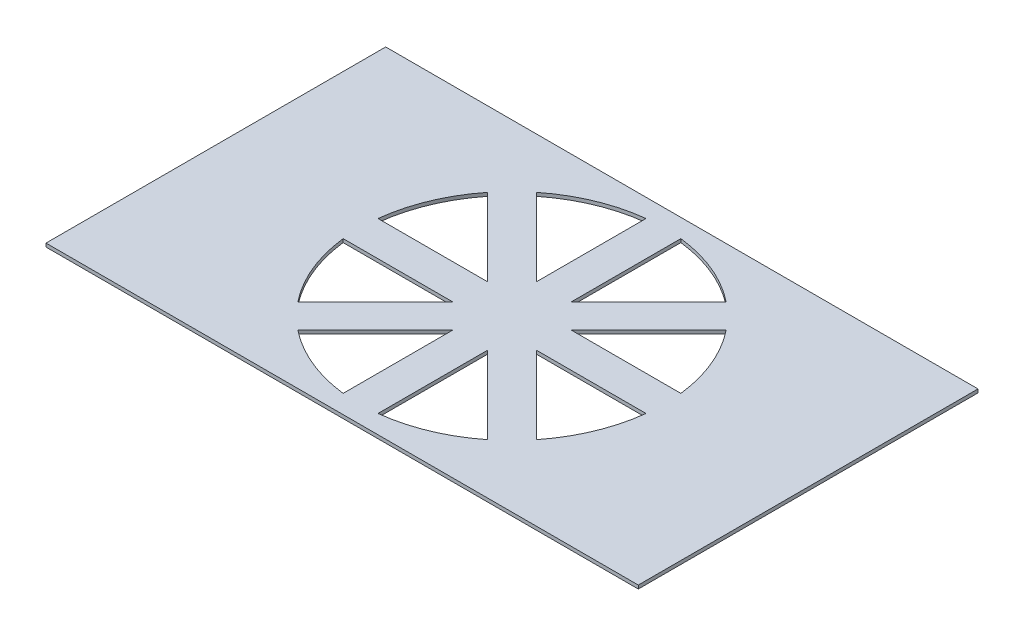
ISO-10303-21;
HEADER;
FILE_DESCRIPTION(('STEP AP214'),'2;1');
FILE_NAME('part.step','',(''),(''),'','','');
FILE_SCHEMA(('AUTOMOTIVE_DESIGN { 1 0 10303 214 1 1 1 1 }'));
ENDSEC;
DATA;
#1=APPLICATION_CONTEXT('core data for automotive mechanical design processes');
#2=APPLICATION_PROTOCOL_DEFINITION('international standard','automotive_design',2000,#1);
#3=PRODUCT_CONTEXT('',#1,'mechanical');
#4=PRODUCT('Part','Part','',(#3));
#5=PRODUCT_RELATED_PRODUCT_CATEGORY('part','',(#4));
#6=PRODUCT_DEFINITION_FORMATION('','',#4);
#7=PRODUCT_DEFINITION_CONTEXT('part definition',#1,'design');
#8=PRODUCT_DEFINITION('design','',#6,#7);
#9=PRODUCT_DEFINITION_SHAPE('','',#8);
#10=(LENGTH_UNIT() NAMED_UNIT(*) SI_UNIT(.MILLI.,.METRE.));
#11=(NAMED_UNIT(*) PLANE_ANGLE_UNIT() SI_UNIT($,.RADIAN.));
#12=(NAMED_UNIT(*) SI_UNIT($,.STERADIAN.) SOLID_ANGLE_UNIT());
#13=UNCERTAINTY_MEASURE_WITH_UNIT(LENGTH_MEASURE(1.E-05),#10,'distance_accuracy_value','');
#14=(GEOMETRIC_REPRESENTATION_CONTEXT(3) GLOBAL_UNCERTAINTY_ASSIGNED_CONTEXT((#13)) GLOBAL_UNIT_ASSIGNED_CONTEXT((#10,
#11,#12)) REPRESENTATION_CONTEXT('',''));
#15=CARTESIAN_POINT('',(0.,0.,0.));
#16=DIRECTION('',(0.,0.,1.));
#17=DIRECTION('',(1.,0.,0.));
#18=AXIS2_PLACEMENT_3D('',#15,#16,#17);
#19=CARTESIAN_POINT('',(0.,0.4,0.));
#20=DIRECTION('',(0.,0.,-1.));
#21=DIRECTION('',(-1.,0.,0.));
#22=AXIS2_PLACEMENT_3D('',#19,#20,#21);
#23=PLANE('',#22);
#24=DIRECTION('',(1.,0.,0.));
#25=VECTOR('',#24,1.);
#26=CARTESIAN_POINT('',(0.,0.,0.));
#27=LINE('',#26,#25);
#28=CARTESIAN_POINT('',(0.,0.,0.));
#29=VERTEX_POINT('',#28);
#30=CARTESIAN_POINT('',(68.,0.,0.));
#31=VERTEX_POINT('',#30);
#32=EDGE_CURVE('E329',#29,#31,#27,.T.);
#33=ORIENTED_EDGE('',*,*,#32,.T.);
#34=DIRECTION('',(0.,-1.,0.));
#35=VECTOR('',#34,1.);
#36=CARTESIAN_POINT('',(68.,0.4,0.));
#37=LINE('',#36,#35);
#38=CARTESIAN_POINT('',(68.,0.4,0.));
#39=VERTEX_POINT('',#38);
#40=EDGE_CURVE('E11',#39,#31,#37,.T.);
#41=ORIENTED_EDGE('',*,*,#40,.F.);
#42=DIRECTION('',(1.,0.,0.));
#43=VECTOR('',#42,1.);
#44=CARTESIAN_POINT('',(0.,0.4,0.));
#45=LINE('',#44,#43);
#46=CARTESIAN_POINT('',(0.,0.4,0.));
#47=VERTEX_POINT('',#46);
#48=EDGE_CURVE('E240',#47,#39,#45,.T.);
#49=ORIENTED_EDGE('',*,*,#48,.F.);
#50=DIRECTION('',(0.,-1.,0.));
#51=VECTOR('',#50,1.);
#52=CARTESIAN_POINT('',(0.,0.4,0.));
#53=LINE('',#52,#51);
#54=EDGE_CURVE('E60',#47,#29,#53,.T.);
#55=ORIENTED_EDGE('',*,*,#54,.T.);
#56=EDGE_LOOP('',(#33,#41,#49,#55));
#57=FACE_BOUND('',#56,.T.);
#58=ADVANCED_FACE('F41',(#57),#23,.F.);
#59=CARTESIAN_POINT('',(68.,0.4,0.));
#60=DIRECTION('',(-1.,0.,0.));
#61=DIRECTION('',(0.,0.,1.));
#62=AXIS2_PLACEMENT_3D('',#59,#60,#61);
#63=PLANE('',#62);
#64=DIRECTION('',(0.,0.,-1.));
#65=VECTOR('',#64,1.);
#66=CARTESIAN_POINT('',(68.,0.,0.));
#67=LINE('',#66,#65);
#68=CARTESIAN_POINT('',(68.,0.,-39.));
#69=VERTEX_POINT('',#68);
#70=EDGE_CURVE('E246',#31,#69,#67,.T.);
#71=ORIENTED_EDGE('',*,*,#70,.T.);
#72=DIRECTION('',(0.,-1.,0.));
#73=VECTOR('',#72,1.);
#74=CARTESIAN_POINT('',(68.,0.4,-39.));
#75=LINE('',#74,#73);
#76=CARTESIAN_POINT('',(68.,0.4,-39.));
#77=VERTEX_POINT('',#76);
#78=EDGE_CURVE('E51',#77,#69,#75,.T.);
#79=ORIENTED_EDGE('',*,*,#78,.F.);
#80=DIRECTION('',(0.,0.,-1.));
#81=VECTOR('',#80,1.);
#82=CARTESIAN_POINT('',(68.,0.4,0.));
#83=LINE('',#82,#81);
#84=EDGE_CURVE('E234',#39,#77,#83,.T.);
#85=ORIENTED_EDGE('',*,*,#84,.F.);
#86=ORIENTED_EDGE('',*,*,#40,.T.);
#87=EDGE_LOOP('',(#71,#79,#85,#86));
#88=FACE_BOUND('',#87,.T.);
#89=ADVANCED_FACE('F245',(#88),#63,.F.);
#90=CARTESIAN_POINT('',(0.,0.4,-39.));
#91=DIRECTION('',(0.,0.,-1.));
#92=DIRECTION('',(-1.,0.,0.));
#93=AXIS2_PLACEMENT_3D('',#90,#91,#92);
#94=PLANE('',#93);
#95=DIRECTION('',(1.,0.,0.));
#96=VECTOR('',#95,1.);
#97=CARTESIAN_POINT('',(0.,0.,-39.));
#98=LINE('',#97,#96);
#99=CARTESIAN_POINT('',(0.,0.,-39.));
#100=VERTEX_POINT('',#99);
#101=EDGE_CURVE('E332',#100,#69,#98,.T.);
#102=ORIENTED_EDGE('',*,*,#101,.F.);
#103=DIRECTION('',(0.,-1.,0.));
#104=VECTOR('',#103,1.);
#105=CARTESIAN_POINT('',(0.,0.4,-39.));
#106=LINE('',#105,#104);
#107=CARTESIAN_POINT('',(0.,0.4,-39.));
#108=VERTEX_POINT('',#107);
#109=EDGE_CURVE('E146',#108,#100,#106,.T.);
#110=ORIENTED_EDGE('',*,*,#109,.F.);
#111=DIRECTION('',(1.,0.,0.));
#112=VECTOR('',#111,1.);
#113=CARTESIAN_POINT('',(0.,0.4,-39.));
#114=LINE('',#113,#112);
#115=EDGE_CURVE('E239',#108,#77,#114,.T.);
#116=ORIENTED_EDGE('',*,*,#115,.T.);
#117=ORIENTED_EDGE('',*,*,#78,.T.);
#118=EDGE_LOOP('',(#102,#110,#116,#117));
#119=FACE_BOUND('',#118,.T.);
#120=ADVANCED_FACE('F250',(#119),#94,.T.);
#121=CARTESIAN_POINT('',(33.9999999999995,0.4,-19.5000000000006));
#122=DIRECTION('',(0.,-1.,0.));
#123=DIRECTION('',(0.,0.,-1.));
#124=AXIS2_PLACEMENT_3D('',#121,#122,#123);
#125=CYLINDRICAL_SURFACE('',#124,17.5);
#126=CARTESIAN_POINT('',(33.9999999999995,0.,-19.5000000000006));
#127=DIRECTION('',(0.,1.,0.));
#128=DIRECTION('',(0.,0.,1.));
#129=AXIS2_PLACEMENT_3D('',#126,#127,#128);
#130=CIRCLE('',#129,17.5);
#131=CARTESIAN_POINT('',(16.6146613492859,0.,-17.4999999999999));
#132=VERTEX_POINT('',#131);
#133=CARTESIAN_POINT('',(20.2924955844828,0.,-8.62092270922862));
#134=VERTEX_POINT('',#133);
#135=EDGE_CURVE('E320',#132,#134,#130,.T.);
#136=ORIENTED_EDGE('',*,*,#135,.F.);
#137=DIRECTION('',(0.,-1.,0.));
#138=VECTOR('',#137,1.);
#139=CARTESIAN_POINT('',(16.6146613492859,0.4,-17.4999999999999));
#140=LINE('',#139,#138);
#141=CARTESIAN_POINT('',(16.6146613492859,0.4,-17.4999999999999));
#142=VERTEX_POINT('',#141);
#143=EDGE_CURVE('E339',#142,#132,#140,.T.);
#144=ORIENTED_EDGE('',*,*,#143,.F.);
#145=CARTESIAN_POINT('',(33.9999999999995,0.4,-19.5000000000006));
#146=DIRECTION('',(0.,1.,0.));
#147=DIRECTION('',(0.,0.,1.));
#148=AXIS2_PLACEMENT_3D('',#145,#146,#147);
#149=CIRCLE('',#148,17.5);
#150=CARTESIAN_POINT('',(20.2924955844828,0.4,-8.62092270922862));
#151=VERTEX_POINT('',#150);
#152=EDGE_CURVE('E453',#142,#151,#149,.T.);
#153=ORIENTED_EDGE('',*,*,#152,.T.);
#154=DIRECTION('',(0.,-1.,0.));
#155=VECTOR('',#154,1.);
#156=CARTESIAN_POINT('',(20.2924955844828,0.4,-8.62092270922862));
#157=LINE('',#156,#155);
#158=EDGE_CURVE('E341',#151,#134,#157,.T.);
#159=ORIENTED_EDGE('',*,*,#158,.T.);
#160=EDGE_LOOP('',(#136,#144,#153,#159));
#161=FACE_BOUND('',#160,.T.);
#162=ADVANCED_FACE('F470',(#161),#125,.F.);
#163=CARTESIAN_POINT('',(-1.30550707585055E-13,0.4,-17.4999999999998));
#164=DIRECTION('',(0.,0.,1.));
#165=DIRECTION('',(1.,0.,0.));
#166=AXIS2_PLACEMENT_3D('',#163,#164,#165);
#167=PLANE('',#166);
#168=DIRECTION('',(-1.,0.,0.));
#169=VECTOR('',#168,1.);
#170=CARTESIAN_POINT('',(-1.30550707585055E-13,0.,-17.4999999999998));
#171=LINE('',#170,#169);
#172=CARTESIAN_POINT('',(29.171572875254,0.,-17.5));
#173=VERTEX_POINT('',#172);
#174=EDGE_CURVE('E323',#173,#132,#171,.T.);
#175=ORIENTED_EDGE('',*,*,#174,.F.);
#176=DIRECTION('',(0.,-1.,0.));
#177=VECTOR('',#176,1.);
#178=CARTESIAN_POINT('',(29.171572875254,0.4,-17.5));
#179=LINE('',#178,#177);
#180=CARTESIAN_POINT('',(29.171572875254,0.4,-17.5));
#181=VERTEX_POINT('',#180);
#182=EDGE_CURVE('E343',#181,#173,#179,.T.);
#183=ORIENTED_EDGE('',*,*,#182,.F.);
#184=DIRECTION('',(-1.,0.,0.));
#185=VECTOR('',#184,1.);
#186=CARTESIAN_POINT('',(-1.30550707585055E-13,0.4,-17.4999999999998));
#187=LINE('',#186,#185);
#188=EDGE_CURVE('E456',#181,#142,#187,.T.);
#189=ORIENTED_EDGE('',*,*,#188,.T.);
#190=ORIENTED_EDGE('',*,*,#143,.T.);
#191=EDGE_LOOP('',(#175,#183,#189,#190));
#192=FACE_BOUND('',#191,.T.);
#193=ADVANCED_FACE('F473',(#192),#167,.T.);
#194=CARTESIAN_POINT('',(33.9999999999995,0.4,-19.5000000000006));
#195=DIRECTION('',(0.,-1.,0.));
#196=DIRECTION('',(0.,0.,-1.));
#197=AXIS2_PLACEMENT_3D('',#194,#195,#196);
#198=CYLINDRICAL_SURFACE('',#197,17.5);
#199=CARTESIAN_POINT('',(33.9999999999995,0.,-19.5000000000006));
#200=DIRECTION('',(0.,1.,0.));
#201=DIRECTION('',(0.,0.,1.));
#202=AXIS2_PLACEMENT_3D('',#199,#200,#201);
#203=CIRCLE('',#202,17.5);
#204=CARTESIAN_POINT('',(23.1209227092292,0.,-5.79249558448261));
#205=VERTEX_POINT('',#204);
#206=CARTESIAN_POINT('',(32.,0.,-2.1146613492868));
#207=VERTEX_POINT('',#206);
#208=EDGE_CURVE('E311',#205,#207,#203,.T.);
#209=ORIENTED_EDGE('',*,*,#208,.F.);
#210=DIRECTION('',(0.,-1.,0.));
#211=VECTOR('',#210,1.);
#212=CARTESIAN_POINT('',(23.1209227092292,0.4,-5.79249558448261));
#213=LINE('',#212,#211);
#214=CARTESIAN_POINT('',(23.1209227092292,0.4,-5.79249558448261));
#215=VERTEX_POINT('',#214);
#216=EDGE_CURVE('E344',#215,#205,#213,.T.);
#217=ORIENTED_EDGE('',*,*,#216,.F.);
#218=CARTESIAN_POINT('',(33.9999999999995,0.4,-19.5000000000006));
#219=DIRECTION('',(0.,1.,0.));
#220=DIRECTION('',(0.,0.,1.));
#221=AXIS2_PLACEMENT_3D('',#218,#219,#220);
#222=CIRCLE('',#221,17.5);
#223=CARTESIAN_POINT('',(32.,0.4,-2.1146613492868));
#224=VERTEX_POINT('',#223);
#225=EDGE_CURVE('E445',#215,#224,#222,.T.);
#226=ORIENTED_EDGE('',*,*,#225,.T.);
#227=DIRECTION('',(0.,-1.,0.));
#228=VECTOR('',#227,1.);
#229=CARTESIAN_POINT('',(32.,0.4,-2.1146613492868));
#230=LINE('',#229,#228);
#231=EDGE_CURVE('E347',#224,#207,#230,.T.);
#232=ORIENTED_EDGE('',*,*,#231,.T.);
#233=EDGE_LOOP('',(#209,#217,#226,#232));
#234=FACE_BOUND('',#233,.T.);
#235=ADVANCED_FACE('F501',(#234),#198,.F.);
#236=CARTESIAN_POINT('',(8.66421356237338,0.4,8.6642135623733));
#237=DIRECTION('',(0.707106781186551,0.,0.707106781186544));
#238=DIRECTION('',(0.707106781186544,0.,-0.707106781186551));
#239=AXIS2_PLACEMENT_3D('',#236,#237,#238);
#240=PLANE('',#239);
#241=DIRECTION('',(-0.707106781186544,0.,0.707106781186551));
#242=VECTOR('',#241,1.);
#243=CARTESIAN_POINT('',(8.66421356237338,0.,8.6642135623733));
#244=LINE('',#243,#242);
#245=CARTESIAN_POINT('',(32.0000000000001,0.,-14.6715728752536));
#246=VERTEX_POINT('',#245);
#247=EDGE_CURVE('E314',#246,#205,#244,.T.);
#248=ORIENTED_EDGE('',*,*,#247,.F.);
#249=DIRECTION('',(0.,-1.,0.));
#250=VECTOR('',#249,1.);
#251=CARTESIAN_POINT('',(32.0000000000001,0.4,-14.6715728752536));
#252=LINE('',#251,#250);
#253=CARTESIAN_POINT('',(32.0000000000001,0.4,-14.6715728752536));
#254=VERTEX_POINT('',#253);
#255=EDGE_CURVE('E349',#254,#246,#252,.T.);
#256=ORIENTED_EDGE('',*,*,#255,.F.);
#257=DIRECTION('',(-0.707106781186544,0.,0.707106781186551));
#258=VECTOR('',#257,1.);
#259=CARTESIAN_POINT('',(8.66421356237338,0.4,8.6642135623733));
#260=LINE('',#259,#258);
#261=EDGE_CURVE('E448',#254,#215,#260,.T.);
#262=ORIENTED_EDGE('',*,*,#261,.T.);
#263=ORIENTED_EDGE('',*,*,#216,.T.);
#264=EDGE_LOOP('',(#248,#256,#262,#263));
#265=FACE_BOUND('',#264,.T.);
#266=ADVANCED_FACE('F508',(#265),#240,.T.);
#267=CARTESIAN_POINT('',(33.9999999999995,0.4,-19.5000000000006));
#268=DIRECTION('',(0.,-1.,0.));
#269=DIRECTION('',(0.,0.,-1.));
#270=AXIS2_PLACEMENT_3D('',#267,#268,#269);
#271=CYLINDRICAL_SURFACE('',#270,17.5);
#272=CARTESIAN_POINT('',(33.9999999999995,0.,-19.5000000000006));
#273=DIRECTION('',(0.,1.,0.));
#274=DIRECTION('',(0.,0.,1.));
#275=AXIS2_PLACEMENT_3D('',#272,#273,#274);
#276=CIRCLE('',#275,17.5);
#277=CARTESIAN_POINT('',(36.,0.,-2.11466134928692));
#278=VERTEX_POINT('',#277);
#279=CARTESIAN_POINT('',(44.8790772907742,0.,-5.79249558448604));
#280=VERTEX_POINT('',#279);
#281=EDGE_CURVE('E302',#278,#280,#276,.T.);
#282=ORIENTED_EDGE('',*,*,#281,.F.);
#283=DIRECTION('',(0.,-1.,0.));
#284=VECTOR('',#283,1.);
#285=CARTESIAN_POINT('',(36.,0.4,-2.11466134928692));
#286=LINE('',#285,#284);
#287=CARTESIAN_POINT('',(36.,0.4,-2.11466134928692));
#288=VERTEX_POINT('',#287);
#289=EDGE_CURVE('E350',#288,#278,#286,.T.);
#290=ORIENTED_EDGE('',*,*,#289,.F.);
#291=CARTESIAN_POINT('',(33.9999999999995,0.4,-19.5000000000006));
#292=DIRECTION('',(0.,1.,0.));
#293=DIRECTION('',(0.,0.,1.));
#294=AXIS2_PLACEMENT_3D('',#291,#292,#293);
#295=CIRCLE('',#294,17.5);
#296=CARTESIAN_POINT('',(44.8790772907742,0.4,-5.79249558448604));
#297=VERTEX_POINT('',#296);
#298=EDGE_CURVE('E436',#288,#297,#295,.T.);
#299=ORIENTED_EDGE('',*,*,#298,.T.);
#300=DIRECTION('',(0.,-1.,0.));
#301=VECTOR('',#300,1.);
#302=CARTESIAN_POINT('',(44.8790772907742,0.4,-5.79249558448604));
#303=LINE('',#302,#301);
#304=EDGE_CURVE('E353',#297,#280,#303,.T.);
#305=ORIENTED_EDGE('',*,*,#304,.T.);
#306=EDGE_LOOP('',(#282,#290,#299,#305));
#307=FACE_BOUND('',#306,.T.);
#308=ADVANCED_FACE('F511',(#307),#271,.F.);
#309=CARTESIAN_POINT('',(36.,0.4,-2.18827852713905E-13));
#310=DIRECTION('',(1.,0.,0.));
#311=DIRECTION('',(0.,0.,-1.));
#312=AXIS2_PLACEMENT_3D('',#309,#310,#311);
#313=PLANE('',#312);
#314=DIRECTION('',(0.,0.,1.));
#315=VECTOR('',#314,1.);
#316=CARTESIAN_POINT('',(36.,0.,-2.18827852713905E-13));
#317=LINE('',#316,#315);
#318=CARTESIAN_POINT('',(36.,0.,-14.6715728752604));
#319=VERTEX_POINT('',#318);
#320=EDGE_CURVE('E305',#319,#278,#317,.T.);
#321=ORIENTED_EDGE('',*,*,#320,.F.);
#322=DIRECTION('',(0.,-1.,0.));
#323=VECTOR('',#322,1.);
#324=CARTESIAN_POINT('',(36.,0.4,-14.6715728752604));
#325=LINE('',#324,#323);
#326=CARTESIAN_POINT('',(36.,0.4,-14.6715728752604));
#327=VERTEX_POINT('',#326);
#328=EDGE_CURVE('E355',#327,#319,#325,.T.);
#329=ORIENTED_EDGE('',*,*,#328,.F.);
#330=DIRECTION('',(0.,0.,1.));
#331=VECTOR('',#330,1.);
#332=CARTESIAN_POINT('',(36.,0.4,-2.18827852713905E-13));
#333=LINE('',#332,#331);
#334=EDGE_CURVE('E439',#327,#288,#333,.T.);
#335=ORIENTED_EDGE('',*,*,#334,.T.);
#336=ORIENTED_EDGE('',*,*,#289,.T.);
#337=EDGE_LOOP('',(#321,#329,#335,#336));
#338=FACE_BOUND('',#337,.T.);
#339=ADVANCED_FACE('F520',(#338),#313,.T.);
#340=CARTESIAN_POINT('',(33.9999999999995,0.4,-19.5000000000006));
#341=DIRECTION('',(0.,-1.,0.));
#342=DIRECTION('',(0.,0.,-1.));
#343=AXIS2_PLACEMENT_3D('',#340,#341,#342);
#344=CYLINDRICAL_SURFACE('',#343,17.5);
#345=CARTESIAN_POINT('',(33.9999999999995,0.,-19.5000000000006));
#346=DIRECTION('',(0.,1.,0.));
#347=DIRECTION('',(0.,0.,1.));
#348=AXIS2_PLACEMENT_3D('',#345,#346,#347);
#349=CIRCLE('',#348,17.5);
#350=CARTESIAN_POINT('',(47.7075044155168,0.,-8.62092270922936));
#351=VERTEX_POINT('',#350);
#352=CARTESIAN_POINT('',(51.3853386507132,0.,-17.4999999999999));
#353=VERTEX_POINT('',#352);
#354=EDGE_CURVE('E293',#351,#353,#349,.T.);
#355=ORIENTED_EDGE('',*,*,#354,.F.);
#356=DIRECTION('',(0.,-1.,0.));
#357=VECTOR('',#356,1.);
#358=CARTESIAN_POINT('',(47.7075044155168,0.4,-8.62092270922936));
#359=LINE('',#358,#357);
#360=CARTESIAN_POINT('',(47.7075044155168,0.4,-8.62092270922936));
#361=VERTEX_POINT('',#360);
#362=EDGE_CURVE('E356',#361,#351,#359,.T.);
#363=ORIENTED_EDGE('',*,*,#362,.F.);
#364=CARTESIAN_POINT('',(33.9999999999995,0.4,-19.5000000000006));
#365=DIRECTION('',(0.,1.,0.));
#366=DIRECTION('',(0.,0.,1.));
#367=AXIS2_PLACEMENT_3D('',#364,#365,#366);
#368=CIRCLE('',#367,17.5);
#369=CARTESIAN_POINT('',(51.3853386507132,0.4,-17.4999999999999));
#370=VERTEX_POINT('',#369);
#371=EDGE_CURVE('E428',#361,#370,#368,.T.);
#372=ORIENTED_EDGE('',*,*,#371,.T.);
#373=DIRECTION('',(0.,-1.,0.));
#374=VECTOR('',#373,1.);
#375=CARTESIAN_POINT('',(51.3853386507132,0.4,-17.4999999999999));
#376=LINE('',#375,#374);
#377=EDGE_CURVE('E359',#370,#353,#376,.T.);
#378=ORIENTED_EDGE('',*,*,#377,.T.);
#379=EDGE_LOOP('',(#355,#363,#372,#378));
#380=FACE_BOUND('',#379,.T.);
#381=ADVANCED_FACE('F523',(#380),#344,.F.);
#382=CARTESIAN_POINT('',(28.1642135623733,0.4,-28.164213562373));
#383=DIRECTION('',(-0.707106781186551,0.,0.707106781186545));
#384=DIRECTION('',(0.707106781186545,0.,0.707106781186551));
#385=AXIS2_PLACEMENT_3D('',#382,#383,#384);
#386=PLANE('',#385);
#387=DIRECTION('',(-0.707106781186544,0.,-0.707106781186551));
#388=VECTOR('',#387,1.);
#389=CARTESIAN_POINT('',(28.1642135623733,0.,-28.164213562373));
#390=LINE('',#389,#388);
#391=CARTESIAN_POINT('',(38.8284271247462,0.,-17.5));
#392=VERTEX_POINT('',#391);
#393=EDGE_CURVE('E296',#351,#392,#390,.T.);
#394=ORIENTED_EDGE('',*,*,#393,.T.);
#395=DIRECTION('',(0.,-1.,0.));
#396=VECTOR('',#395,1.);
#397=CARTESIAN_POINT('',(38.8284271247462,0.4,-17.5));
#398=LINE('',#397,#396);
#399=CARTESIAN_POINT('',(38.8284271247462,0.4,-17.5));
#400=VERTEX_POINT('',#399);
#401=EDGE_CURVE('E361',#400,#392,#398,.T.);
#402=ORIENTED_EDGE('',*,*,#401,.F.);
#403=DIRECTION('',(-0.707106781186544,0.,-0.707106781186551));
#404=VECTOR('',#403,1.);
#405=CARTESIAN_POINT('',(28.1642135623733,0.4,-28.164213562373));
#406=LINE('',#405,#404);
#407=EDGE_CURVE('E431',#361,#400,#406,.T.);
#408=ORIENTED_EDGE('',*,*,#407,.F.);
#409=ORIENTED_EDGE('',*,*,#362,.T.);
#410=EDGE_LOOP('',(#394,#402,#408,#409));
#411=FACE_BOUND('',#410,.T.);
#412=ADVANCED_FACE('F532',(#411),#386,.F.);
#413=CARTESIAN_POINT('',(33.9999999999995,0.4,-19.5000000000006));
#414=DIRECTION('',(0.,-1.,0.));
#415=DIRECTION('',(0.,0.,-1.));
#416=AXIS2_PLACEMENT_3D('',#413,#414,#415);
#417=CYLINDRICAL_SURFACE('',#416,17.5);
#418=CARTESIAN_POINT('',(33.9999999999995,0.,-19.5000000000006));
#419=DIRECTION('',(0.,1.,0.));
#420=DIRECTION('',(0.,0.,1.));
#421=AXIS2_PLACEMENT_3D('',#418,#419,#420);
#422=CIRCLE('',#421,17.5);
#423=CARTESIAN_POINT('',(51.3853386507133,0.,-21.5));
#424=VERTEX_POINT('',#423);
#425=CARTESIAN_POINT('',(47.7075044155174,0.,-30.379077290771));
#426=VERTEX_POINT('',#425);
#427=EDGE_CURVE('E284',#424,#426,#422,.T.);
#428=ORIENTED_EDGE('',*,*,#427,.F.);
#429=DIRECTION('',(0.,-1.,0.));
#430=VECTOR('',#429,1.);
#431=CARTESIAN_POINT('',(51.3853386507133,0.4,-21.5));
#432=LINE('',#431,#430);
#433=CARTESIAN_POINT('',(51.3853386507133,0.4,-21.5));
#434=VERTEX_POINT('',#433);
#435=EDGE_CURVE('E362',#434,#424,#432,.T.);
#436=ORIENTED_EDGE('',*,*,#435,.F.);
#437=CARTESIAN_POINT('',(33.9999999999995,0.4,-19.5000000000006));
#438=DIRECTION('',(0.,1.,0.));
#439=DIRECTION('',(0.,0.,1.));
#440=AXIS2_PLACEMENT_3D('',#437,#438,#439);
#441=CIRCLE('',#440,17.5);
#442=CARTESIAN_POINT('',(47.7075044155174,0.4,-30.379077290771));
#443=VERTEX_POINT('',#442);
#444=EDGE_CURVE('E420',#434,#443,#441,.T.);
#445=ORIENTED_EDGE('',*,*,#444,.T.);
#446=DIRECTION('',(0.,-1.,0.));
#447=VECTOR('',#446,1.);
#448=CARTESIAN_POINT('',(47.7075044155174,0.4,-30.379077290771));
#449=LINE('',#448,#447);
#450=EDGE_CURVE('E365',#443,#426,#449,.T.);
#451=ORIENTED_EDGE('',*,*,#450,.T.);
#452=EDGE_LOOP('',(#428,#436,#445,#451));
#453=FACE_BOUND('',#452,.T.);
#454=ADVANCED_FACE('F535',(#453),#417,.F.);
#455=CARTESIAN_POINT('',(0.,0.4,-21.5));
#456=DIRECTION('',(0.,0.,1.));
#457=DIRECTION('',(1.,0.,0.));
#458=AXIS2_PLACEMENT_3D('',#455,#456,#457);
#459=PLANE('',#458);
#460=DIRECTION('',(-1.,0.,0.));
#461=VECTOR('',#460,1.);
#462=CARTESIAN_POINT('',(0.,0.,-21.5));
#463=LINE('',#462,#461);
#464=CARTESIAN_POINT('',(38.8284271247465,0.,-21.5));
#465=VERTEX_POINT('',#464);
#466=EDGE_CURVE('E287',#424,#465,#463,.T.);
#467=ORIENTED_EDGE('',*,*,#466,.T.);
#468=DIRECTION('',(0.,-1.,0.));
#469=VECTOR('',#468,1.);
#470=CARTESIAN_POINT('',(38.8284271247465,0.4,-21.5));
#471=LINE('',#470,#469);
#472=CARTESIAN_POINT('',(38.8284271247465,0.4,-21.5));
#473=VERTEX_POINT('',#472);
#474=EDGE_CURVE('E367',#473,#465,#471,.T.);
#475=ORIENTED_EDGE('',*,*,#474,.F.);
#476=DIRECTION('',(-1.,0.,0.));
#477=VECTOR('',#476,1.);
#478=CARTESIAN_POINT('',(0.,0.4,-21.5));
#479=LINE('',#478,#477);
#480=EDGE_CURVE('E423',#434,#473,#479,.T.);
#481=ORIENTED_EDGE('',*,*,#480,.F.);
#482=ORIENTED_EDGE('',*,*,#435,.T.);
#483=EDGE_LOOP('',(#467,#475,#481,#482));
#484=FACE_BOUND('',#483,.T.);
#485=ADVANCED_FACE('F544',(#484),#459,.F.);
#486=CARTESIAN_POINT('',(33.9999999999995,0.4,-19.5000000000006));
#487=DIRECTION('',(0.,-1.,0.));
#488=DIRECTION('',(0.,0.,-1.));
#489=AXIS2_PLACEMENT_3D('',#486,#487,#488);
#490=CYLINDRICAL_SURFACE('',#489,17.5);
#491=CARTESIAN_POINT('',(33.9999999999995,0.,-19.5000000000006));
#492=DIRECTION('',(0.,1.,0.));
#493=DIRECTION('',(0.,0.,1.));
#494=AXIS2_PLACEMENT_3D('',#491,#492,#493);
#495=CIRCLE('',#494,17.5);
#496=CARTESIAN_POINT('',(44.8790772907714,0.,-33.2075044155173));
#497=VERTEX_POINT('',#496);
#498=CARTESIAN_POINT('',(36.,0.,-36.8853386507142));
#499=VERTEX_POINT('',#498);
#500=EDGE_CURVE('E275',#497,#499,#495,.T.);
#501=ORIENTED_EDGE('',*,*,#500,.F.);
#502=DIRECTION('',(0.,-1.,0.));
#503=VECTOR('',#502,1.);
#504=CARTESIAN_POINT('',(44.8790772907714,0.4,-33.2075044155173));
#505=LINE('',#504,#503);
#506=CARTESIAN_POINT('',(44.8790772907714,0.4,-33.2075044155173));
#507=VERTEX_POINT('',#506);
#508=EDGE_CURVE('E368',#507,#497,#505,.T.);
#509=ORIENTED_EDGE('',*,*,#508,.F.);
#510=CARTESIAN_POINT('',(33.9999999999995,0.4,-19.5000000000006));
#511=DIRECTION('',(0.,1.,0.));
#512=DIRECTION('',(0.,0.,1.));
#513=AXIS2_PLACEMENT_3D('',#510,#511,#512);
#514=CIRCLE('',#513,17.5);
#515=CARTESIAN_POINT('',(36.,0.4,-36.8853386507142));
#516=VERTEX_POINT('',#515);
#517=EDGE_CURVE('E412',#507,#516,#514,.T.);
#518=ORIENTED_EDGE('',*,*,#517,.T.);
#519=DIRECTION('',(0.,-1.,0.));
#520=VECTOR('',#519,1.);
#521=CARTESIAN_POINT('',(36.,0.4,-36.8853386507142));
#522=LINE('',#521,#520);
#523=EDGE_CURVE('E371',#516,#499,#522,.T.);
#524=ORIENTED_EDGE('',*,*,#523,.T.);
#525=EDGE_LOOP('',(#501,#509,#518,#524));
#526=FACE_BOUND('',#525,.T.);
#527=ADVANCED_FACE('F547',(#526),#490,.F.);
#528=CARTESIAN_POINT('',(5.83578643762708,0.4,5.83578643762707));
#529=DIRECTION('',(0.707106781186548,0.,0.707106781186547));
#530=DIRECTION('',(0.707106781186547,0.,-0.707106781186548));
#531=AXIS2_PLACEMENT_3D('',#528,#529,#530);
#532=PLANE('',#531);
#533=DIRECTION('',(-0.707106781186547,0.,0.707106781186548));
#534=VECTOR('',#533,1.);
#535=CARTESIAN_POINT('',(5.83578643762708,0.,5.83578643762707));
#536=LINE('',#535,#534);
#537=CARTESIAN_POINT('',(36.,0.,-24.3284271247459));
#538=VERTEX_POINT('',#537);
#539=EDGE_CURVE('E278',#497,#538,#536,.T.);
#540=ORIENTED_EDGE('',*,*,#539,.T.);
#541=DIRECTION('',(0.,-1.,0.));
#542=VECTOR('',#541,1.);
#543=CARTESIAN_POINT('',(36.,0.4,-24.3284271247459));
#544=LINE('',#543,#542);
#545=CARTESIAN_POINT('',(36.,0.4,-24.3284271247459));
#546=VERTEX_POINT('',#545);
#547=EDGE_CURVE('E373',#546,#538,#544,.T.);
#548=ORIENTED_EDGE('',*,*,#547,.F.);
#549=DIRECTION('',(-0.707106781186547,0.,0.707106781186548));
#550=VECTOR('',#549,1.);
#551=CARTESIAN_POINT('',(5.83578643762708,0.4,5.83578643762707));
#552=LINE('',#551,#550);
#553=EDGE_CURVE('E415',#507,#546,#552,.T.);
#554=ORIENTED_EDGE('',*,*,#553,.F.);
#555=ORIENTED_EDGE('',*,*,#508,.T.);
#556=EDGE_LOOP('',(#540,#548,#554,#555));
#557=FACE_BOUND('',#556,.T.);
#558=ADVANCED_FACE('F555',(#557),#532,.F.);
#559=CARTESIAN_POINT('',(33.9999999999995,0.4,-19.5000000000006));
#560=DIRECTION('',(0.,-1.,0.));
#561=DIRECTION('',(0.,0.,-1.));
#562=AXIS2_PLACEMENT_3D('',#559,#560,#561);
#563=CYLINDRICAL_SURFACE('',#562,17.5);
#564=CARTESIAN_POINT('',(33.9999999999995,0.,-19.5000000000006));
#565=DIRECTION('',(0.,1.,0.));
#566=DIRECTION('',(0.,0.,1.));
#567=AXIS2_PLACEMENT_3D('',#564,#565,#566);
#568=CIRCLE('',#567,17.5);
#569=CARTESIAN_POINT('',(32.,0.,-36.8853386507143));
#570=VERTEX_POINT('',#569);
#571=CARTESIAN_POINT('',(23.1209227092249,0.,-33.2075044155152));
#572=VERTEX_POINT('',#571);
#573=EDGE_CURVE('E266',#570,#572,#568,.T.);
#574=ORIENTED_EDGE('',*,*,#573,.F.);
#575=DIRECTION('',(0.,-1.,0.));
#576=VECTOR('',#575,1.);
#577=CARTESIAN_POINT('',(32.,0.4,-36.8853386507143));
#578=LINE('',#577,#576);
#579=CARTESIAN_POINT('',(32.,0.4,-36.8853386507143));
#580=VERTEX_POINT('',#579);
#581=EDGE_CURVE('E374',#580,#570,#578,.T.);
#582=ORIENTED_EDGE('',*,*,#581,.F.);
#583=CARTESIAN_POINT('',(33.9999999999995,0.4,-19.5000000000006));
#584=DIRECTION('',(0.,1.,0.));
#585=DIRECTION('',(0.,0.,1.));
#586=AXIS2_PLACEMENT_3D('',#583,#584,#585);
#587=CIRCLE('',#586,17.5);
#588=CARTESIAN_POINT('',(23.1209227092249,0.4,-33.2075044155152));
#589=VERTEX_POINT('',#588);
#590=EDGE_CURVE('E404',#580,#589,#587,.T.);
#591=ORIENTED_EDGE('',*,*,#590,.T.);
#592=DIRECTION('',(0.,-1.,0.));
#593=VECTOR('',#592,1.);
#594=CARTESIAN_POINT('',(23.1209227092249,0.4,-33.2075044155152));
#595=LINE('',#594,#593);
#596=EDGE_CURVE('E377',#589,#572,#595,.T.);
#597=ORIENTED_EDGE('',*,*,#596,.T.);
#598=EDGE_LOOP('',(#574,#582,#591,#597));
#599=FACE_BOUND('',#598,.T.);
#600=ADVANCED_FACE('F558',(#599),#563,.F.);
#601=CARTESIAN_POINT('',(32.0000000000003,0.4,-2.29879764467233E-13));
#602=DIRECTION('',(1.,0.,0.));
#603=DIRECTION('',(0.,0.,-1.));
#604=AXIS2_PLACEMENT_3D('',#601,#602,#603);
#605=PLANE('',#604);
#606=DIRECTION('',(0.,0.,1.));
#607=VECTOR('',#606,1.);
#608=CARTESIAN_POINT('',(32.0000000000003,0.,-2.29879764467233E-13));
#609=LINE('',#608,#607);
#610=CARTESIAN_POINT('',(32.0000000000001,0.,-24.3284271247462));
#611=VERTEX_POINT('',#610);
#612=EDGE_CURVE('E269',#570,#611,#609,.T.);
#613=ORIENTED_EDGE('',*,*,#612,.T.);
#614=DIRECTION('',(0.,-1.,0.));
#615=VECTOR('',#614,1.);
#616=CARTESIAN_POINT('',(32.0000000000001,0.4,-24.3284271247462));
#617=LINE('',#616,#615);
#618=CARTESIAN_POINT('',(32.0000000000001,0.4,-24.3284271247462));
#619=VERTEX_POINT('',#618);
#620=EDGE_CURVE('E379',#619,#611,#617,.T.);
#621=ORIENTED_EDGE('',*,*,#620,.F.);
#622=DIRECTION('',(0.,0.,1.));
#623=VECTOR('',#622,1.);
#624=CARTESIAN_POINT('',(32.0000000000003,0.4,-2.29879764467233E-13));
#625=LINE('',#624,#623);
#626=EDGE_CURVE('E407',#580,#619,#625,.T.);
#627=ORIENTED_EDGE('',*,*,#626,.F.);
#628=ORIENTED_EDGE('',*,*,#581,.T.);
#629=EDGE_LOOP('',(#613,#621,#627,#628));
#630=FACE_BOUND('',#629,.T.);
#631=ADVANCED_FACE('F566',(#630),#605,.F.);
#632=CARTESIAN_POINT('',(33.9999999999995,0.4,-19.5000000000006));
#633=DIRECTION('',(0.,-1.,0.));
#634=DIRECTION('',(0.,0.,-1.));
#635=AXIS2_PLACEMENT_3D('',#632,#633,#634);
#636=CYLINDRICAL_SURFACE('',#635,17.5);
#637=CARTESIAN_POINT('',(33.9999999999995,0.,-19.5000000000006));
#638=DIRECTION('',(0.,1.,0.));
#639=DIRECTION('',(0.,0.,1.));
#640=AXIS2_PLACEMENT_3D('',#637,#638,#639);
#641=CIRCLE('',#640,17.5);
#642=CARTESIAN_POINT('',(20.2924955844794,0.,-30.3790772907682));
#643=VERTEX_POINT('',#642);
#644=CARTESIAN_POINT('',(16.6146613492858,0.,-21.5));
#645=VERTEX_POINT('',#644);
#646=EDGE_CURVE('E257',#643,#645,#641,.T.);
#647=ORIENTED_EDGE('',*,*,#646,.F.);
#648=DIRECTION('',(0.,-1.,0.));
#649=VECTOR('',#648,1.);
#650=CARTESIAN_POINT('',(20.2924955844794,0.4,-30.3790772907682));
#651=LINE('',#650,#649);
#652=CARTESIAN_POINT('',(20.2924955844794,0.4,-30.3790772907682));
#653=VERTEX_POINT('',#652);
#654=EDGE_CURVE('E45',#653,#643,#651,.T.);
#655=ORIENTED_EDGE('',*,*,#654,.F.);
#656=CARTESIAN_POINT('',(33.9999999999995,0.4,-19.5000000000006));
#657=DIRECTION('',(0.,1.,0.));
#658=DIRECTION('',(0.,0.,1.));
#659=AXIS2_PLACEMENT_3D('',#656,#657,#658);
#660=CIRCLE('',#659,17.5);
#661=CARTESIAN_POINT('',(16.6146613492858,0.4,-21.5));
#662=VERTEX_POINT('',#661);
#663=EDGE_CURVE('E337',#653,#662,#660,.T.);
#664=ORIENTED_EDGE('',*,*,#663,.T.);
#665=DIRECTION('',(0.,-1.,0.));
#666=VECTOR('',#665,1.);
#667=CARTESIAN_POINT('',(16.6146613492858,0.4,-21.5));
#668=LINE('',#667,#666);
#669=EDGE_CURVE('E253',#662,#645,#668,.T.);
#670=ORIENTED_EDGE('',*,*,#669,.T.);
#671=EDGE_LOOP('',(#647,#655,#664,#670));
#672=FACE_BOUND('',#671,.T.);
#673=ADVANCED_FACE('F43',(#672),#636,.F.);
#674=CARTESIAN_POINT('',(25.3357864376167,0.4,-25.3357864376345));
#675=DIRECTION('',(-0.707106781186298,0.,0.707106781186797));
#676=DIRECTION('',(0.707106781186797,0.,0.707106781186298));
#677=AXIS2_PLACEMENT_3D('',#674,#675,#676);
#678=PLANE('',#677);
#679=DIRECTION('',(-0.707106781186797,0.,-0.707106781186298));
#680=VECTOR('',#679,1.);
#681=CARTESIAN_POINT('',(25.3357864376167,0.,-25.3357864376345));
#682=LINE('',#681,#680);
#683=CARTESIAN_POINT('',(29.1715728752539,0.,-21.5));
#684=VERTEX_POINT('',#683);
#685=EDGE_CURVE('E260',#684,#643,#682,.T.);
#686=ORIENTED_EDGE('',*,*,#685,.F.);
#687=DIRECTION('',(0.,-1.,0.));
#688=VECTOR('',#687,1.);
#689=CARTESIAN_POINT('',(29.1715728752539,0.4,-21.5));
#690=LINE('',#689,#688);
#691=CARTESIAN_POINT('',(29.1715728752539,0.4,-21.5));
#692=VERTEX_POINT('',#691);
#693=EDGE_CURVE('E383',#692,#684,#690,.T.);
#694=ORIENTED_EDGE('',*,*,#693,.F.);
#695=DIRECTION('',(-0.707106781186797,0.,-0.707106781186298));
#696=VECTOR('',#695,1.);
#697=CARTESIAN_POINT('',(25.3357864376167,0.4,-25.3357864376345));
#698=LINE('',#697,#696);
#699=EDGE_CURVE('E392',#692,#653,#698,.T.);
#700=ORIENTED_EDGE('',*,*,#699,.T.);
#701=ORIENTED_EDGE('',*,*,#654,.T.);
#702=EDGE_LOOP('',(#686,#694,#700,#701));
#703=FACE_BOUND('',#702,.T.);
#704=ADVANCED_FACE('F390',(#703),#678,.T.);
#705=CARTESIAN_POINT('',(5.83578643762736,0.4,5.83578643762721));
#706=DIRECTION('',(0.707106781186557,0.,0.707106781186539));
#707=DIRECTION('',(0.707106781186539,0.,-0.707106781186557));
#708=AXIS2_PLACEMENT_3D('',#705,#706,#707);
#709=PLANE('',#708);
#710=DIRECTION('',(-0.707106781186539,0.,0.707106781186557));
#711=VECTOR('',#710,1.);
#712=CARTESIAN_POINT('',(5.83578643762736,0.,5.83578643762721));
#713=LINE('',#712,#711);
#714=EDGE_CURVE('E326',#173,#134,#713,.T.);
#715=ORIENTED_EDGE('',*,*,#714,.T.);
#716=ORIENTED_EDGE('',*,*,#158,.F.);
#717=DIRECTION('',(-0.707106781186539,0.,0.707106781186557));
#718=VECTOR('',#717,1.);
#719=CARTESIAN_POINT('',(5.83578643762736,0.4,5.83578643762721));
#720=LINE('',#719,#718);
#721=EDGE_CURVE('E459',#181,#151,#720,.T.);
#722=ORIENTED_EDGE('',*,*,#721,.F.);
#723=ORIENTED_EDGE('',*,*,#182,.T.);
#724=EDGE_LOOP('',(#715,#716,#722,#723));
#725=FACE_BOUND('',#724,.T.);
#726=ADVANCED_FACE('F466',(#725),#709,.F.);
#727=CARTESIAN_POINT('',(32.,0.4,0.));
#728=DIRECTION('',(1.,0.,0.));
#729=DIRECTION('',(0.,0.,-1.));
#730=AXIS2_PLACEMENT_3D('',#727,#728,#729);
#731=PLANE('',#730);
#732=DIRECTION('',(0.,0.,1.));
#733=VECTOR('',#732,1.);
#734=CARTESIAN_POINT('',(32.,0.,0.));
#735=LINE('',#734,#733);
#736=EDGE_CURVE('E317',#246,#207,#735,.T.);
#737=ORIENTED_EDGE('',*,*,#736,.T.);
#738=ORIENTED_EDGE('',*,*,#231,.F.);
#739=DIRECTION('',(0.,0.,1.));
#740=VECTOR('',#739,1.);
#741=CARTESIAN_POINT('',(32.,0.4,0.));
#742=LINE('',#741,#740);
#743=EDGE_CURVE('E451',#254,#224,#742,.T.);
#744=ORIENTED_EDGE('',*,*,#743,.F.);
#745=ORIENTED_EDGE('',*,*,#255,.T.);
#746=EDGE_LOOP('',(#737,#738,#744,#745));
#747=FACE_BOUND('',#746,.T.);
#748=ADVANCED_FACE('F498',(#747),#731,.F.);
#749=CARTESIAN_POINT('',(25.3357864376304,0.4,-25.3357864376301));
#750=DIRECTION('',(-0.707106781186551,0.,0.707106781186544));
#751=DIRECTION('',(0.707106781186544,0.,0.707106781186551));
#752=AXIS2_PLACEMENT_3D('',#749,#750,#751);
#753=PLANE('',#752);
#754=DIRECTION('',(-0.707106781186544,0.,-0.707106781186551));
#755=VECTOR('',#754,1.);
#756=CARTESIAN_POINT('',(25.3357864376304,0.,-25.3357864376301));
#757=LINE('',#756,#755);
#758=EDGE_CURVE('E308',#280,#319,#757,.T.);
#759=ORIENTED_EDGE('',*,*,#758,.F.);
#760=ORIENTED_EDGE('',*,*,#304,.F.);
#761=DIRECTION('',(-0.707106781186544,0.,-0.707106781186551));
#762=VECTOR('',#761,1.);
#763=CARTESIAN_POINT('',(25.3357864376304,0.4,-25.3357864376301));
#764=LINE('',#763,#762);
#765=EDGE_CURVE('E442',#297,#327,#764,.T.);
#766=ORIENTED_EDGE('',*,*,#765,.T.);
#767=ORIENTED_EDGE('',*,*,#328,.T.);
#768=EDGE_LOOP('',(#759,#760,#766,#767));
#769=FACE_BOUND('',#768,.T.);
#770=ADVANCED_FACE('F506',(#769),#753,.T.);
#771=CARTESIAN_POINT('',(1.11209862016912E-13,0.4,-17.5000000000002));
#772=DIRECTION('',(0.,0.,1.));
#773=DIRECTION('',(1.,0.,0.));
#774=AXIS2_PLACEMENT_3D('',#771,#772,#773);
#775=PLANE('',#774);
#776=DIRECTION('',(-1.,0.,0.));
#777=VECTOR('',#776,1.);
#778=CARTESIAN_POINT('',(1.11209862016912E-13,0.,-17.5000000000002));
#779=LINE('',#778,#777);
#780=EDGE_CURVE('E299',#353,#392,#779,.T.);
#781=ORIENTED_EDGE('',*,*,#780,.F.);
#782=ORIENTED_EDGE('',*,*,#377,.F.);
#783=DIRECTION('',(-1.,0.,0.));
#784=VECTOR('',#783,1.);
#785=CARTESIAN_POINT('',(1.11209862016912E-13,0.4,-17.5000000000002));
#786=LINE('',#785,#784);
#787=EDGE_CURVE('E433',#370,#400,#786,.T.);
#788=ORIENTED_EDGE('',*,*,#787,.T.);
#789=ORIENTED_EDGE('',*,*,#401,.T.);
#790=EDGE_LOOP('',(#781,#782,#788,#789));
#791=FACE_BOUND('',#790,.T.);
#792=ADVANCED_FACE('F518',(#791),#775,.T.);
#793=CARTESIAN_POINT('',(8.66421356237335,0.4,8.6642135623733));
#794=DIRECTION('',(0.707106781186549,0.,0.707106781186546));
#795=DIRECTION('',(0.707106781186546,0.,-0.707106781186549));
#796=AXIS2_PLACEMENT_3D('',#793,#794,#795);
#797=PLANE('',#796);
#798=DIRECTION('',(-0.707106781186546,0.,0.707106781186549));
#799=VECTOR('',#798,1.);
#800=CARTESIAN_POINT('',(8.66421356237335,0.,8.6642135623733));
#801=LINE('',#800,#799);
#802=EDGE_CURVE('E290',#426,#465,#801,.T.);
#803=ORIENTED_EDGE('',*,*,#802,.F.);
#804=ORIENTED_EDGE('',*,*,#450,.F.);
#805=DIRECTION('',(-0.707106781186546,0.,0.707106781186549));
#806=VECTOR('',#805,1.);
#807=CARTESIAN_POINT('',(8.66421356237335,0.4,8.6642135623733));
#808=LINE('',#807,#806);
#809=EDGE_CURVE('E425',#443,#473,#808,.T.);
#810=ORIENTED_EDGE('',*,*,#809,.T.);
#811=ORIENTED_EDGE('',*,*,#474,.T.);
#812=EDGE_LOOP('',(#803,#804,#810,#811));
#813=FACE_BOUND('',#812,.T.);
#814=ADVANCED_FACE('F530',(#813),#797,.T.);
#815=CARTESIAN_POINT('',(36.,0.4,0.));
#816=DIRECTION('',(1.,0.,0.));
#817=DIRECTION('',(0.,0.,-1.));
#818=AXIS2_PLACEMENT_3D('',#815,#816,#817);
#819=PLANE('',#818);
#820=DIRECTION('',(0.,0.,1.));
#821=VECTOR('',#820,1.);
#822=CARTESIAN_POINT('',(36.,0.,0.));
#823=LINE('',#822,#821);
#824=EDGE_CURVE('E281',#499,#538,#823,.T.);
#825=ORIENTED_EDGE('',*,*,#824,.F.);
#826=ORIENTED_EDGE('',*,*,#523,.F.);
#827=DIRECTION('',(0.,0.,1.));
#828=VECTOR('',#827,1.);
#829=CARTESIAN_POINT('',(36.,0.4,0.));
#830=LINE('',#829,#828);
#831=EDGE_CURVE('E417',#516,#546,#830,.T.);
#832=ORIENTED_EDGE('',*,*,#831,.T.);
#833=ORIENTED_EDGE('',*,*,#547,.T.);
#834=EDGE_LOOP('',(#825,#826,#832,#833));
#835=FACE_BOUND('',#834,.T.);
#836=ADVANCED_FACE('F542',(#835),#819,.T.);
#837=CARTESIAN_POINT('',(28.1642135623619,0.4,-28.1642135623818));
#838=DIRECTION('',(-0.707106781186298,0.,0.707106781186797));
#839=DIRECTION('',(0.707106781186797,0.,0.707106781186298));
#840=AXIS2_PLACEMENT_3D('',#837,#838,#839);
#841=PLANE('',#840);
#842=DIRECTION('',(-0.707106781186797,0.,-0.707106781186298));
#843=VECTOR('',#842,1.);
#844=CARTESIAN_POINT('',(28.1642135623619,0.,-28.1642135623818));
#845=LINE('',#844,#843);
#846=EDGE_CURVE('E272',#611,#572,#845,.T.);
#847=ORIENTED_EDGE('',*,*,#846,.T.);
#848=ORIENTED_EDGE('',*,*,#596,.F.);
#849=DIRECTION('',(-0.707106781186797,0.,-0.707106781186298));
#850=VECTOR('',#849,1.);
#851=CARTESIAN_POINT('',(28.1642135623619,0.4,-28.1642135623818));
#852=LINE('',#851,#850);
#853=EDGE_CURVE('E410',#619,#589,#852,.T.);
#854=ORIENTED_EDGE('',*,*,#853,.F.);
#855=ORIENTED_EDGE('',*,*,#620,.T.);
#856=EDGE_LOOP('',(#847,#848,#854,#855));
#857=FACE_BOUND('',#856,.T.);
#858=ADVANCED_FACE('F486',(#857),#841,.F.);
#859=CARTESIAN_POINT('',(0.,0.4,-21.5));
#860=DIRECTION('',(0.,0.,1.));
#861=DIRECTION('',(1.,0.,0.));
#862=AXIS2_PLACEMENT_3D('',#859,#860,#861);
#863=PLANE('',#862);
#864=DIRECTION('',(-1.,0.,0.));
#865=VECTOR('',#864,1.);
#866=CARTESIAN_POINT('',(0.,0.,-21.5));
#867=LINE('',#866,#865);
#868=EDGE_CURVE('E263',#684,#645,#867,.T.);
#869=ORIENTED_EDGE('',*,*,#868,.T.);
#870=ORIENTED_EDGE('',*,*,#669,.F.);
#871=DIRECTION('',(-1.,0.,0.));
#872=VECTOR('',#871,1.);
#873=CARTESIAN_POINT('',(0.,0.4,-21.5));
#874=LINE('',#873,#872);
#875=EDGE_CURVE('E398',#692,#662,#874,.T.);
#876=ORIENTED_EDGE('',*,*,#875,.F.);
#877=ORIENTED_EDGE('',*,*,#693,.T.);
#878=EDGE_LOOP('',(#869,#870,#876,#877));
#879=FACE_BOUND('',#878,.T.);
#880=ADVANCED_FACE('F397',(#879),#863,.F.);
#881=CARTESIAN_POINT('',(0.,0.4,0.));
#882=DIRECTION('',(-1.,0.,0.));
#883=DIRECTION('',(0.,0.,1.));
#884=AXIS2_PLACEMENT_3D('',#881,#882,#883);
#885=PLANE('',#884);
#886=DIRECTION('',(0.,0.,-1.));
#887=VECTOR('',#886,1.);
#888=CARTESIAN_POINT('',(0.,0.,0.));
#889=LINE('',#888,#887);
#890=EDGE_CURVE('E334',#29,#100,#889,.T.);
#891=ORIENTED_EDGE('',*,*,#890,.F.);
#892=ORIENTED_EDGE('',*,*,#54,.F.);
#893=DIRECTION('',(0.,0.,-1.));
#894=VECTOR('',#893,1.);
#895=CARTESIAN_POINT('',(0.,0.4,0.));
#896=LINE('',#895,#894);
#897=EDGE_CURVE('E251',#47,#108,#896,.T.);
#898=ORIENTED_EDGE('',*,*,#897,.T.);
#899=ORIENTED_EDGE('',*,*,#109,.T.);
#900=EDGE_LOOP('',(#891,#892,#898,#899));
#901=FACE_BOUND('',#900,.T.);
#902=ADVANCED_FACE('F478',(#901),#885,.T.);
#903=CARTESIAN_POINT('',(0.,0.4,0.));
#904=DIRECTION('',(0.,1.,0.));
#905=DIRECTION('',(0.,0.,1.));
#906=AXIS2_PLACEMENT_3D('',#903,#904,#905);
#907=PLANE('',#906);
#908=ORIENTED_EDGE('',*,*,#663,.F.);
#909=ORIENTED_EDGE('',*,*,#699,.F.);
#910=ORIENTED_EDGE('',*,*,#875,.T.);
#911=EDGE_LOOP('',(#908,#909,#910));
#912=FACE_BOUND('',#911,.T.);
#913=ORIENTED_EDGE('',*,*,#590,.F.);
#914=ORIENTED_EDGE('',*,*,#626,.T.);
#915=ORIENTED_EDGE('',*,*,#853,.T.);
#916=EDGE_LOOP('',(#913,#914,#915));
#917=FACE_BOUND('',#916,.T.);
#918=ORIENTED_EDGE('',*,*,#517,.F.);
#919=ORIENTED_EDGE('',*,*,#553,.T.);
#920=ORIENTED_EDGE('',*,*,#831,.F.);
#921=EDGE_LOOP('',(#918,#919,#920));
#922=FACE_BOUND('',#921,.T.);
#923=ORIENTED_EDGE('',*,*,#444,.F.);
#924=ORIENTED_EDGE('',*,*,#480,.T.);
#925=ORIENTED_EDGE('',*,*,#809,.F.);
#926=EDGE_LOOP('',(#923,#924,#925));
#927=FACE_BOUND('',#926,.T.);
#928=ORIENTED_EDGE('',*,*,#371,.F.);
#929=ORIENTED_EDGE('',*,*,#407,.T.);
#930=ORIENTED_EDGE('',*,*,#787,.F.);
#931=EDGE_LOOP('',(#928,#929,#930));
#932=FACE_BOUND('',#931,.T.);
#933=ORIENTED_EDGE('',*,*,#298,.F.);
#934=ORIENTED_EDGE('',*,*,#334,.F.);
#935=ORIENTED_EDGE('',*,*,#765,.F.);
#936=EDGE_LOOP('',(#933,#934,#935));
#937=FACE_BOUND('',#936,.T.);
#938=ORIENTED_EDGE('',*,*,#225,.F.);
#939=ORIENTED_EDGE('',*,*,#261,.F.);
#940=ORIENTED_EDGE('',*,*,#743,.T.);
#941=EDGE_LOOP('',(#938,#939,#940));
#942=FACE_BOUND('',#941,.T.);
#943=ORIENTED_EDGE('',*,*,#152,.F.);
#944=ORIENTED_EDGE('',*,*,#188,.F.);
#945=ORIENTED_EDGE('',*,*,#721,.T.);
#946=EDGE_LOOP('',(#943,#944,#945));
#947=FACE_BOUND('',#946,.T.);
#948=ORIENTED_EDGE('',*,*,#48,.T.);
#949=ORIENTED_EDGE('',*,*,#84,.T.);
#950=ORIENTED_EDGE('',*,*,#115,.F.);
#951=ORIENTED_EDGE('',*,*,#897,.F.);
#952=EDGE_LOOP('',(#948,#949,#950,#951));
#953=FACE_BOUND('',#952,.T.);
#954=ADVANCED_FACE('F236',(#912,#917,#922,#927,#932,#937,#942,#947,#953),#907,.T.);
#955=CARTESIAN_POINT('',(0.,0.,0.));
#956=DIRECTION('',(0.,1.,0.));
#957=DIRECTION('',(0.,0.,1.));
#958=AXIS2_PLACEMENT_3D('',#955,#956,#957);
#959=PLANE('',#958);
#960=ORIENTED_EDGE('',*,*,#646,.T.);
#961=ORIENTED_EDGE('',*,*,#868,.F.);
#962=ORIENTED_EDGE('',*,*,#685,.T.);
#963=EDGE_LOOP('',(#960,#961,#962));
#964=FACE_BOUND('',#963,.T.);
#965=ORIENTED_EDGE('',*,*,#573,.T.);
#966=ORIENTED_EDGE('',*,*,#846,.F.);
#967=ORIENTED_EDGE('',*,*,#612,.F.);
#968=EDGE_LOOP('',(#965,#966,#967));
#969=FACE_BOUND('',#968,.T.);
#970=ORIENTED_EDGE('',*,*,#500,.T.);
#971=ORIENTED_EDGE('',*,*,#824,.T.);
#972=ORIENTED_EDGE('',*,*,#539,.F.);
#973=EDGE_LOOP('',(#970,#971,#972));
#974=FACE_BOUND('',#973,.T.);
#975=ORIENTED_EDGE('',*,*,#427,.T.);
#976=ORIENTED_EDGE('',*,*,#802,.T.);
#977=ORIENTED_EDGE('',*,*,#466,.F.);
#978=EDGE_LOOP('',(#975,#976,#977));
#979=FACE_BOUND('',#978,.T.);
#980=ORIENTED_EDGE('',*,*,#354,.T.);
#981=ORIENTED_EDGE('',*,*,#780,.T.);
#982=ORIENTED_EDGE('',*,*,#393,.F.);
#983=EDGE_LOOP('',(#980,#981,#982));
#984=FACE_BOUND('',#983,.T.);
#985=ORIENTED_EDGE('',*,*,#281,.T.);
#986=ORIENTED_EDGE('',*,*,#758,.T.);
#987=ORIENTED_EDGE('',*,*,#320,.T.);
#988=EDGE_LOOP('',(#985,#986,#987));
#989=FACE_BOUND('',#988,.T.);
#990=ORIENTED_EDGE('',*,*,#208,.T.);
#991=ORIENTED_EDGE('',*,*,#736,.F.);
#992=ORIENTED_EDGE('',*,*,#247,.T.);
#993=EDGE_LOOP('',(#990,#991,#992));
#994=FACE_BOUND('',#993,.T.);
#995=ORIENTED_EDGE('',*,*,#135,.T.);
#996=ORIENTED_EDGE('',*,*,#714,.F.);
#997=ORIENTED_EDGE('',*,*,#174,.T.);
#998=EDGE_LOOP('',(#995,#996,#997));
#999=FACE_BOUND('',#998,.T.);
#1000=ORIENTED_EDGE('',*,*,#32,.F.);
#1001=ORIENTED_EDGE('',*,*,#890,.T.);
#1002=ORIENTED_EDGE('',*,*,#101,.T.);
#1003=ORIENTED_EDGE('',*,*,#70,.F.);
#1004=EDGE_LOOP('',(#1000,#1001,#1002,#1003));
#1005=FACE_BOUND('',#1004,.T.);
#1006=ADVANCED_FACE('F395',(#964,#969,#974,#979,#984,#989,#994,#999,#1005),#959,.F.);
#1007=CLOSED_SHELL('',(#58,#89,#120,#162,#193,#235,#266,#308,#339,#381,#412,#454,#485,#527,#558,
#600,#631,#673,#704,#726,#748,#770,#792,#814,#836,#858,#880,#902,#954,#1006));
#1008=MANIFOLD_SOLID_BREP('B2',#1007);
#1009=ADVANCED_BREP_SHAPE_REPRESENTATION('',(#18,#1008),#14);
#1010=SHAPE_DEFINITION_REPRESENTATION(#9,#1009);
ENDSEC;
END-ISO-10303-21;
